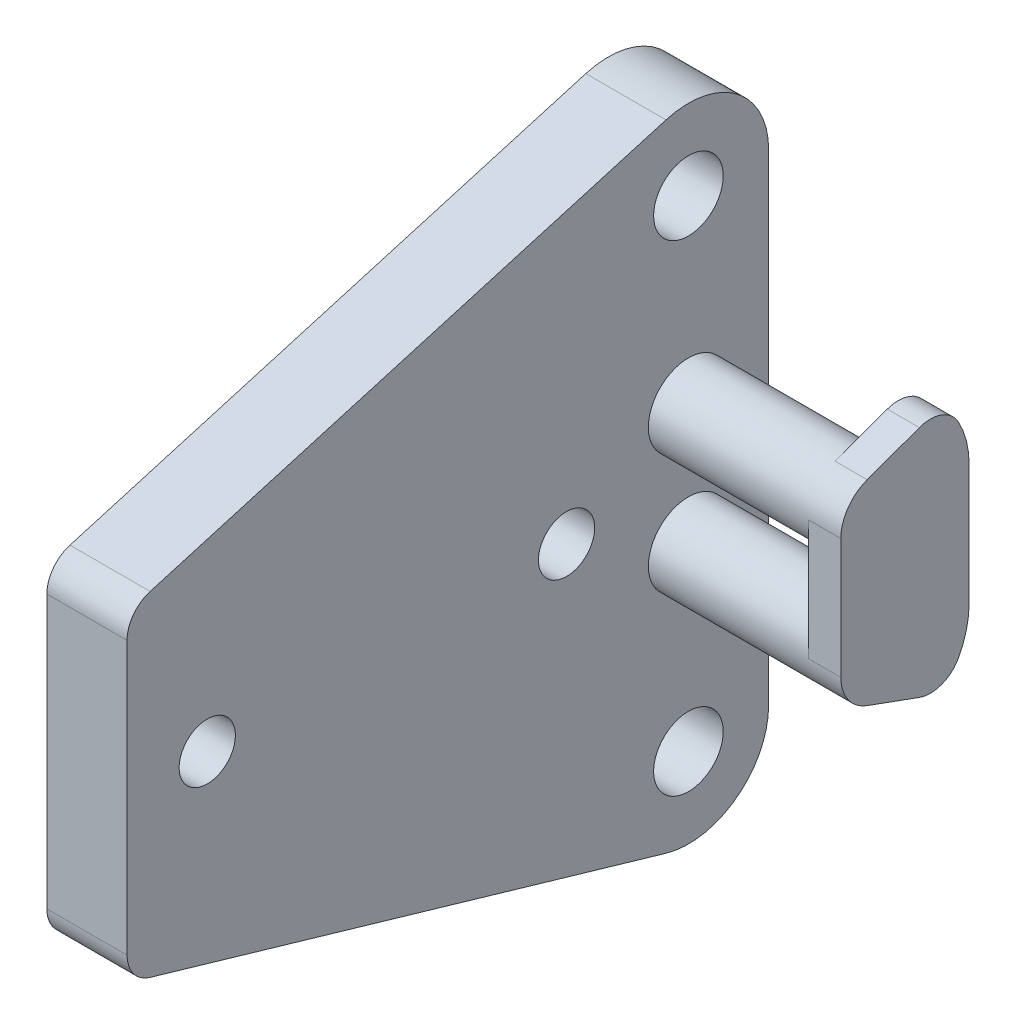
ISO-10303-21;
HEADER;
FILE_DESCRIPTION(('STEP AP214'),'2;1');
FILE_NAME('part.step','',(''),(''),'','','');
FILE_SCHEMA(('AUTOMOTIVE_DESIGN { 1 0 10303 214 1 1 1 1 }'));
ENDSEC;
DATA;
#1=APPLICATION_CONTEXT('core data for automotive mechanical design processes');
#2=APPLICATION_PROTOCOL_DEFINITION('international standard','automotive_design',2000,#1);
#3=PRODUCT_CONTEXT('',#1,'mechanical');
#4=PRODUCT('Part','Part','',(#3));
#5=PRODUCT_RELATED_PRODUCT_CATEGORY('part','',(#4));
#6=PRODUCT_DEFINITION_FORMATION('','',#4);
#7=PRODUCT_DEFINITION_CONTEXT('part definition',#1,'design');
#8=PRODUCT_DEFINITION('design','',#6,#7);
#9=PRODUCT_DEFINITION_SHAPE('','',#8);
#10=(LENGTH_UNIT() NAMED_UNIT(*) SI_UNIT(.MILLI.,.METRE.));
#11=(NAMED_UNIT(*) PLANE_ANGLE_UNIT() SI_UNIT($,.RADIAN.));
#12=(NAMED_UNIT(*) SI_UNIT($,.STERADIAN.) SOLID_ANGLE_UNIT());
#13=UNCERTAINTY_MEASURE_WITH_UNIT(LENGTH_MEASURE(1.E-05),#10,'distance_accuracy_value','');
#14=(GEOMETRIC_REPRESENTATION_CONTEXT(3) GLOBAL_UNCERTAINTY_ASSIGNED_CONTEXT((#13)) GLOBAL_UNIT_ASSIGNED_CONTEXT((#10,
#11,#12)) REPRESENTATION_CONTEXT('',''));
#15=CARTESIAN_POINT('',(0.,0.,0.));
#16=DIRECTION('',(0.,0.,1.));
#17=DIRECTION('',(1.,0.,0.));
#18=AXIS2_PLACEMENT_3D('',#15,#16,#17);
#19=CARTESIAN_POINT('',(-6.35,12.7,44.45));
#20=DIRECTION('',(0.,0.96,0.28));
#21=DIRECTION('',(0.,-0.28,0.96));
#22=AXIS2_PLACEMENT_3D('',#19,#20,#21);
#23=PLANE('',#22);
#24=DIRECTION('',(0.,-0.28,0.96));
#25=VECTOR('',#24,1.);
#26=CARTESIAN_POINT('',(-6.35,12.7,44.45));
#27=LINE('',#26,#25);
#28=CARTESIAN_POINT('',(-6.35,25.146,1.778));
#29=VERTEX_POINT('',#28);
#30=CARTESIAN_POINT('',(-6.35,13.2334,42.6212));
#31=VERTEX_POINT('',#30);
#32=EDGE_CURVE('E222',#29,#31,#27,.T.);
#33=ORIENTED_EDGE('',*,*,#32,.T.);
#34=DIRECTION('',(1.,0.,0.));
#35=VECTOR('',#34,1.);
#36=CARTESIAN_POINT('',(-6.35,13.2334,42.6212));
#37=LINE('',#36,#35);
#38=CARTESIAN_POINT('',(0.,13.2334,42.6212));
#39=VERTEX_POINT('',#38);
#40=EDGE_CURVE('E11',#31,#39,#37,.T.);
#41=ORIENTED_EDGE('',*,*,#40,.T.);
#42=DIRECTION('',(0.,-0.28,0.96));
#43=VECTOR('',#42,1.);
#44=CARTESIAN_POINT('',(0.,12.7,44.45));
#45=LINE('',#44,#43);
#46=CARTESIAN_POINT('',(0.,25.146,1.778));
#47=VERTEX_POINT('',#46);
#48=EDGE_CURVE('E219',#47,#39,#45,.T.);
#49=ORIENTED_EDGE('',*,*,#48,.F.);
#50=DIRECTION('',(1.,0.,0.));
#51=VECTOR('',#50,1.);
#52=CARTESIAN_POINT('',(-6.35,25.146,1.778));
#53=LINE('',#52,#51);
#54=EDGE_CURVE('E255',#29,#47,#53,.T.);
#55=ORIENTED_EDGE('',*,*,#54,.F.);
#56=EDGE_LOOP('',(#33,#41,#49,#55));
#57=FACE_BOUND('',#56,.T.);
#58=ADVANCED_FACE('F33',(#57),#23,.T.);
#59=CARTESIAN_POINT('',(-6.35,19.05,0.));
#60=DIRECTION('',(1.,0.,0.));
#61=DIRECTION('',(0.,0.,-1.));
#62=AXIS2_PLACEMENT_3D('',#59,#60,#61);
#63=CYLINDRICAL_SURFACE('',#62,6.35);
#64=CARTESIAN_POINT('',(0.,19.05,0.));
#65=DIRECTION('',(1.,0.,0.));
#66=DIRECTION('',(0.,0.,1.));
#67=AXIS2_PLACEMENT_3D('',#64,#65,#66);
#68=CIRCLE('',#67,6.35);
#69=CARTESIAN_POINT('',(0.,19.05,-6.35000000000001));
#70=VERTEX_POINT('',#69);
#71=EDGE_CURVE('E225',#70,#47,#68,.T.);
#72=ORIENTED_EDGE('',*,*,#71,.F.);
#73=DIRECTION('',(1.,0.,0.));
#74=VECTOR('',#73,1.);
#75=CARTESIAN_POINT('',(-6.35,19.05,-6.35000000000001));
#76=LINE('',#75,#74);
#77=CARTESIAN_POINT('',(-6.35,19.05,-6.35000000000001));
#78=VERTEX_POINT('',#77);
#79=EDGE_CURVE('E258',#78,#70,#76,.T.);
#80=ORIENTED_EDGE('',*,*,#79,.F.);
#81=CARTESIAN_POINT('',(-6.35,19.05,0.));
#82=DIRECTION('',(1.,0.,0.));
#83=DIRECTION('',(0.,0.,1.));
#84=AXIS2_PLACEMENT_3D('',#81,#82,#83);
#85=CIRCLE('',#84,6.35);
#86=EDGE_CURVE('E236',#78,#29,#85,.T.);
#87=ORIENTED_EDGE('',*,*,#86,.T.);
#88=ORIENTED_EDGE('',*,*,#54,.T.);
#89=EDGE_LOOP('',(#72,#80,#87,#88));
#90=FACE_BOUND('',#89,.T.);
#91=ADVANCED_FACE('F318',(#90),#63,.T.);
#92=CARTESIAN_POINT('',(-6.35,-19.05,-6.35000000000001));
#93=DIRECTION('',(0.,0.,-1.));
#94=DIRECTION('',(-1.,0.,0.));
#95=AXIS2_PLACEMENT_3D('',#92,#93,#94);
#96=PLANE('',#95);
#97=DIRECTION('',(0.,1.,0.));
#98=VECTOR('',#97,1.);
#99=CARTESIAN_POINT('',(0.,-19.05,-6.35000000000001));
#100=LINE('',#99,#98);
#101=CARTESIAN_POINT('',(0.,-19.05,-6.35000000000001));
#102=VERTEX_POINT('',#101);
#103=EDGE_CURVE('E250',#102,#70,#100,.T.);
#104=ORIENTED_EDGE('',*,*,#103,.F.);
#105=DIRECTION('',(1.,0.,0.));
#106=VECTOR('',#105,1.);
#107=CARTESIAN_POINT('',(-6.35,-19.05,-6.35000000000001));
#108=LINE('',#107,#106);
#109=CARTESIAN_POINT('',(-6.35,-19.05,-6.35000000000001));
#110=VERTEX_POINT('',#109);
#111=EDGE_CURVE('E260',#110,#102,#108,.T.);
#112=ORIENTED_EDGE('',*,*,#111,.F.);
#113=DIRECTION('',(0.,1.,0.));
#114=VECTOR('',#113,1.);
#115=CARTESIAN_POINT('',(-6.35,-19.05,-6.35000000000001));
#116=LINE('',#115,#114);
#117=EDGE_CURVE('E233',#110,#78,#116,.T.);
#118=ORIENTED_EDGE('',*,*,#117,.T.);
#119=ORIENTED_EDGE('',*,*,#79,.T.);
#120=EDGE_LOOP('',(#104,#112,#118,#119));
#121=FACE_BOUND('',#120,.T.);
#122=ADVANCED_FACE('F334',(#121),#96,.T.);
#123=CARTESIAN_POINT('',(-6.35,-19.05,0.));
#124=DIRECTION('',(1.,0.,0.));
#125=DIRECTION('',(0.,0.,-1.));
#126=AXIS2_PLACEMENT_3D('',#123,#124,#125);
#127=CYLINDRICAL_SURFACE('',#126,6.35);
#128=CARTESIAN_POINT('',(0.,-19.05,0.));
#129=DIRECTION('',(1.,0.,0.));
#130=DIRECTION('',(0.,0.,-1.));
#131=AXIS2_PLACEMENT_3D('',#128,#129,#130);
#132=CIRCLE('',#131,6.35);
#133=CARTESIAN_POINT('',(0.,-25.146,1.77799999999999));
#134=VERTEX_POINT('',#133);
#135=EDGE_CURVE('E247',#134,#102,#132,.T.);
#136=ORIENTED_EDGE('',*,*,#135,.F.);
#137=DIRECTION('',(1.,0.,0.));
#138=VECTOR('',#137,1.);
#139=CARTESIAN_POINT('',(-6.35,-25.146,1.77799999999999));
#140=LINE('',#139,#138);
#141=CARTESIAN_POINT('',(-6.35,-25.146,1.77799999999999));
#142=VERTEX_POINT('',#141);
#143=EDGE_CURVE('E239',#142,#134,#140,.T.);
#144=ORIENTED_EDGE('',*,*,#143,.F.);
#145=CARTESIAN_POINT('',(-6.35,-19.05,0.));
#146=DIRECTION('',(1.,0.,0.));
#147=DIRECTION('',(0.,0.,-1.));
#148=AXIS2_PLACEMENT_3D('',#145,#146,#147);
#149=CIRCLE('',#148,6.35);
#150=EDGE_CURVE('E230',#142,#110,#149,.T.);
#151=ORIENTED_EDGE('',*,*,#150,.T.);
#152=ORIENTED_EDGE('',*,*,#111,.T.);
#153=EDGE_LOOP('',(#136,#144,#151,#152));
#154=FACE_BOUND('',#153,.T.);
#155=ADVANCED_FACE('F313',(#154),#127,.T.);
#156=CARTESIAN_POINT('',(-6.35,-12.7,44.45));
#157=DIRECTION('',(0.,-0.96,0.28));
#158=DIRECTION('',(0.,-0.28,-0.96));
#159=AXIS2_PLACEMENT_3D('',#156,#157,#158);
#160=PLANE('',#159);
#161=DIRECTION('',(0.,-0.28,-0.96));
#162=VECTOR('',#161,1.);
#163=CARTESIAN_POINT('',(0.,-12.7,44.45));
#164=LINE('',#163,#162);
#165=CARTESIAN_POINT('',(0.,-13.2334,42.6212));
#166=VERTEX_POINT('',#165);
#167=EDGE_CURVE('E245',#166,#134,#164,.T.);
#168=ORIENTED_EDGE('',*,*,#167,.F.);
#169=DIRECTION('',(1.,0.,0.));
#170=VECTOR('',#169,1.);
#171=CARTESIAN_POINT('',(-6.35,-13.2334,42.6212));
#172=LINE('',#171,#170);
#173=CARTESIAN_POINT('',(-6.35,-13.2334,42.6212));
#174=VERTEX_POINT('',#173);
#175=EDGE_CURVE('E56',#166,#174,#172,.F.);
#176=ORIENTED_EDGE('',*,*,#175,.T.);
#177=DIRECTION('',(0.,-0.28,-0.96));
#178=VECTOR('',#177,1.);
#179=CARTESIAN_POINT('',(-6.35,-12.7,44.45));
#180=LINE('',#179,#178);
#181=EDGE_CURVE('E228',#174,#142,#180,.T.);
#182=ORIENTED_EDGE('',*,*,#181,.T.);
#183=ORIENTED_EDGE('',*,*,#143,.T.);
#184=EDGE_LOOP('',(#168,#176,#182,#183));
#185=FACE_BOUND('',#184,.T.);
#186=ADVANCED_FACE('F309',(#185),#160,.T.);
#187=CARTESIAN_POINT('',(-6.35,12.7,44.45));
#188=DIRECTION('',(0.,0.,1.));
#189=DIRECTION('',(1.,0.,0.));
#190=AXIS2_PLACEMENT_3D('',#187,#188,#189);
#191=PLANE('',#190);
#192=DIRECTION('',(0.,-1.,0.));
#193=VECTOR('',#192,1.);
#194=CARTESIAN_POINT('',(-6.35,12.7,44.45));
#195=LINE('',#194,#193);
#196=CARTESIAN_POINT('',(-6.35,10.795,44.45));
#197=VERTEX_POINT('',#196);
#198=CARTESIAN_POINT('',(-6.35,-10.795,44.45));
#199=VERTEX_POINT('',#198);
#200=EDGE_CURVE('E224',#197,#199,#195,.T.);
#201=ORIENTED_EDGE('',*,*,#200,.T.);
#202=DIRECTION('',(1.,0.,0.));
#203=VECTOR('',#202,1.);
#204=CARTESIAN_POINT('',(-6.35,-10.795,44.45));
#205=LINE('',#204,#203);
#206=CARTESIAN_POINT('',(0.,-10.795,44.45));
#207=VERTEX_POINT('',#206);
#208=EDGE_CURVE('E289',#199,#207,#205,.T.);
#209=ORIENTED_EDGE('',*,*,#208,.T.);
#210=DIRECTION('',(0.,-1.,0.));
#211=VECTOR('',#210,1.);
#212=CARTESIAN_POINT('',(0.,12.7,44.45));
#213=LINE('',#212,#211);
#214=CARTESIAN_POINT('',(0.,10.795,44.45));
#215=VERTEX_POINT('',#214);
#216=EDGE_CURVE('E242',#215,#207,#213,.T.);
#217=ORIENTED_EDGE('',*,*,#216,.F.);
#218=DIRECTION('',(1.,0.,0.));
#219=VECTOR('',#218,1.);
#220=CARTESIAN_POINT('',(-6.35,10.795,44.45));
#221=LINE('',#220,#219);
#222=EDGE_CURVE('E287',#215,#197,#221,.F.);
#223=ORIENTED_EDGE('',*,*,#222,.T.);
#224=EDGE_LOOP('',(#201,#209,#217,#223));
#225=FACE_BOUND('',#224,.T.);
#226=ADVANCED_FACE('F303',(#225),#191,.T.);
#227=CARTESIAN_POINT('',(-6.35,19.05,0.));
#228=DIRECTION('',(-1.,0.,0.));
#229=DIRECTION('',(0.,0.,1.));
#230=AXIS2_PLACEMENT_3D('',#227,#228,#229);
#231=PLANE('',#230);
#232=CARTESIAN_POINT('',(-6.35,-19.05,0.));
#233=DIRECTION('',(1.,0.,0.));
#234=DIRECTION('',(0.,0.,-1.));
#235=AXIS2_PLACEMENT_3D('',#232,#233,#234);
#236=CIRCLE('',#235,2.7559);
#237=CARTESIAN_POINT('',(-6.35,-19.05,-2.7559));
#238=VERTEX_POINT('',#237);
#239=EDGE_CURVE('E198',#238,#238,#236,.T.);
#240=ORIENTED_EDGE('',*,*,#239,.T.);
#241=EDGE_LOOP('',(#240));
#242=FACE_BOUND('',#241,.T.);
#243=CARTESIAN_POINT('',(-6.35,19.05,0.));
#244=DIRECTION('',(1.,0.,0.));
#245=DIRECTION('',(0.,0.,1.));
#246=AXIS2_PLACEMENT_3D('',#243,#244,#245);
#247=CIRCLE('',#246,2.75590000000001);
#248=CARTESIAN_POINT('',(-6.35,19.05,2.75590000000002));
#249=VERTEX_POINT('',#248);
#250=EDGE_CURVE('E204',#249,#249,#247,.T.);
#251=ORIENTED_EDGE('',*,*,#250,.T.);
#252=EDGE_LOOP('',(#251));
#253=FACE_BOUND('',#252,.T.);
#254=CARTESIAN_POINT('',(-6.35,0.,9.65199999999999));
#255=DIRECTION('',(1.,0.,0.));
#256=DIRECTION('',(0.,0.,-1.));
#257=AXIS2_PLACEMENT_3D('',#254,#255,#256);
#258=CIRCLE('',#257,2.22670754032473);
#259=CARTESIAN_POINT('',(-6.35,0.,7.42529245967526));
#260=VERTEX_POINT('',#259);
#261=EDGE_CURVE('E210',#260,#260,#258,.T.);
#262=ORIENTED_EDGE('',*,*,#261,.T.);
#263=EDGE_LOOP('',(#262));
#264=FACE_BOUND('',#263,.T.);
#265=CARTESIAN_POINT('',(-6.35,0.,38.1));
#266=DIRECTION('',(1.,0.,0.));
#267=DIRECTION('',(0.,0.,-1.));
#268=AXIS2_PLACEMENT_3D('',#265,#266,#267);
#269=CIRCLE('',#268,2.22670754032473);
#270=CARTESIAN_POINT('',(-6.35,0.,35.8732924596753));
#271=VERTEX_POINT('',#270);
#272=EDGE_CURVE('E216',#271,#271,#269,.T.);
#273=ORIENTED_EDGE('',*,*,#272,.T.);
#274=EDGE_LOOP('',(#273));
#275=FACE_BOUND('',#274,.T.);
#276=ORIENTED_EDGE('',*,*,#181,.F.);
#277=CARTESIAN_POINT('',(-6.35,-10.795,41.91));
#278=DIRECTION('',(-1.,0.,0.));
#279=DIRECTION('',(0.,0.,1.));
#280=AXIS2_PLACEMENT_3D('',#277,#278,#279);
#281=CIRCLE('',#280,2.54);
#282=EDGE_CURVE('E41',#174,#199,#281,.T.);
#283=ORIENTED_EDGE('',*,*,#282,.T.);
#284=ORIENTED_EDGE('',*,*,#200,.F.);
#285=CARTESIAN_POINT('',(-6.35,10.795,41.91));
#286=DIRECTION('',(-1.,0.,0.));
#287=DIRECTION('',(0.,0.,1.));
#288=AXIS2_PLACEMENT_3D('',#285,#286,#287);
#289=CIRCLE('',#288,2.54);
#290=EDGE_CURVE('E48',#197,#31,#289,.T.);
#291=ORIENTED_EDGE('',*,*,#290,.T.);
#292=ORIENTED_EDGE('',*,*,#32,.F.);
#293=ORIENTED_EDGE('',*,*,#86,.F.);
#294=ORIENTED_EDGE('',*,*,#117,.F.);
#295=ORIENTED_EDGE('',*,*,#150,.F.);
#296=EDGE_LOOP('',(#276,#283,#284,#291,#292,#293,#294,#295));
#297=FACE_BOUND('',#296,.T.);
#298=ADVANCED_FACE('F298',(#242,#253,#264,#275,#297),#231,.T.);
#299=CARTESIAN_POINT('',(0.,19.05,0.));
#300=DIRECTION('',(-1.,0.,0.));
#301=DIRECTION('',(0.,0.,1.));
#302=AXIS2_PLACEMENT_3D('',#299,#300,#301);
#303=PLANE('',#302);
#304=CARTESIAN_POINT('',(0.,4.7625,0.));
#305=DIRECTION('',(-1.,0.,0.));
#306=DIRECTION('',(0.,0.,1.));
#307=AXIS2_PLACEMENT_3D('',#304,#305,#306);
#308=CIRCLE('',#307,3.175);
#309=CARTESIAN_POINT('',(0.,4.7625,3.17499999999999));
#310=VERTEX_POINT('',#309);
#311=EDGE_CURVE('E266',#310,#310,#308,.F.);
#312=ORIENTED_EDGE('',*,*,#311,.F.);
#313=EDGE_LOOP('',(#312));
#314=FACE_BOUND('',#313,.T.);
#315=CARTESIAN_POINT('',(0.,-4.7625,0.));
#316=DIRECTION('',(-1.,0.,0.));
#317=DIRECTION('',(0.,0.,1.));
#318=AXIS2_PLACEMENT_3D('',#315,#316,#317);
#319=CIRCLE('',#318,3.175);
#320=CARTESIAN_POINT('',(0.,-4.7625,3.17499999999999));
#321=VERTEX_POINT('',#320);
#322=EDGE_CURVE('E257',#321,#321,#319,.F.);
#323=ORIENTED_EDGE('',*,*,#322,.F.);
#324=EDGE_LOOP('',(#323));
#325=FACE_BOUND('',#324,.T.);
#326=CARTESIAN_POINT('',(0.,-19.05,0.));
#327=DIRECTION('',(1.,0.,0.));
#328=DIRECTION('',(0.,0.,-1.));
#329=AXIS2_PLACEMENT_3D('',#326,#327,#328);
#330=CIRCLE('',#329,2.7559);
#331=CARTESIAN_POINT('',(0.,-19.05,-2.7559));
#332=VERTEX_POINT('',#331);
#333=EDGE_CURVE('E196',#332,#332,#330,.T.);
#334=ORIENTED_EDGE('',*,*,#333,.F.);
#335=EDGE_LOOP('',(#334));
#336=FACE_BOUND('',#335,.T.);
#337=CARTESIAN_POINT('',(0.,19.05,0.));
#338=DIRECTION('',(1.,0.,0.));
#339=DIRECTION('',(0.,0.,1.));
#340=AXIS2_PLACEMENT_3D('',#337,#338,#339);
#341=CIRCLE('',#340,2.75590000000001);
#342=CARTESIAN_POINT('',(0.,19.05,2.75590000000002));
#343=VERTEX_POINT('',#342);
#344=EDGE_CURVE('E201',#343,#343,#341,.T.);
#345=ORIENTED_EDGE('',*,*,#344,.F.);
#346=EDGE_LOOP('',(#345));
#347=FACE_BOUND('',#346,.T.);
#348=CARTESIAN_POINT('',(0.,0.,9.65199999999999));
#349=DIRECTION('',(1.,0.,0.));
#350=DIRECTION('',(0.,0.,-1.));
#351=AXIS2_PLACEMENT_3D('',#348,#349,#350);
#352=CIRCLE('',#351,2.22670754032473);
#353=CARTESIAN_POINT('',(0.,0.,7.42529245967526));
#354=VERTEX_POINT('',#353);
#355=EDGE_CURVE('E207',#354,#354,#352,.T.);
#356=ORIENTED_EDGE('',*,*,#355,.F.);
#357=EDGE_LOOP('',(#356));
#358=FACE_BOUND('',#357,.T.);
#359=CARTESIAN_POINT('',(0.,0.,38.1));
#360=DIRECTION('',(1.,0.,0.));
#361=DIRECTION('',(0.,0.,-1.));
#362=AXIS2_PLACEMENT_3D('',#359,#360,#361);
#363=CIRCLE('',#362,2.22670754032473);
#364=CARTESIAN_POINT('',(0.,0.,35.8732924596753));
#365=VERTEX_POINT('',#364);
#366=EDGE_CURVE('E213',#365,#365,#363,.T.);
#367=ORIENTED_EDGE('',*,*,#366,.F.);
#368=EDGE_LOOP('',(#367));
#369=FACE_BOUND('',#368,.T.);
#370=ORIENTED_EDGE('',*,*,#216,.T.);
#371=CARTESIAN_POINT('',(0.,-10.795,41.91));
#372=DIRECTION('',(-1.,0.,0.));
#373=DIRECTION('',(0.,0.,1.));
#374=AXIS2_PLACEMENT_3D('',#371,#372,#373);
#375=CIRCLE('',#374,2.54);
#376=EDGE_CURVE('E294',#207,#166,#375,.F.);
#377=ORIENTED_EDGE('',*,*,#376,.T.);
#378=ORIENTED_EDGE('',*,*,#167,.T.);
#379=ORIENTED_EDGE('',*,*,#135,.T.);
#380=ORIENTED_EDGE('',*,*,#103,.T.);
#381=ORIENTED_EDGE('',*,*,#71,.T.);
#382=ORIENTED_EDGE('',*,*,#48,.T.);
#383=CARTESIAN_POINT('',(0.,10.795,41.91));
#384=DIRECTION('',(-1.,0.,0.));
#385=DIRECTION('',(0.,0.,1.));
#386=AXIS2_PLACEMENT_3D('',#383,#384,#385);
#387=CIRCLE('',#386,2.54);
#388=EDGE_CURVE('E292',#39,#215,#387,.F.);
#389=ORIENTED_EDGE('',*,*,#388,.T.);
#390=EDGE_LOOP('',(#370,#377,#378,#379,#380,#381,#382,#389));
#391=FACE_BOUND('',#390,.T.);
#392=ADVANCED_FACE('F308',(#314,#325,#336,#347,#358,#369,#391),#303,.F.);
#393=CARTESIAN_POINT('',(-6.35,0.,38.1));
#394=DIRECTION('',(1.,0.,0.));
#395=DIRECTION('',(0.,0.,-1.));
#396=AXIS2_PLACEMENT_3D('',#393,#394,#395);
#397=CYLINDRICAL_SURFACE('',#396,2.22670754032473);
#398=ORIENTED_EDGE('',*,*,#272,.F.);
#399=EDGE_LOOP('',(#398));
#400=FACE_BOUND('',#399,.T.);
#401=ORIENTED_EDGE('',*,*,#366,.T.);
#402=EDGE_LOOP('',(#401));
#403=FACE_BOUND('',#402,.T.);
#404=ADVANCED_FACE('F419',(#400,#403),#397,.F.);
#405=CARTESIAN_POINT('',(-6.35,0.,9.65199999999999));
#406=DIRECTION('',(1.,0.,0.));
#407=DIRECTION('',(0.,0.,-1.));
#408=AXIS2_PLACEMENT_3D('',#405,#406,#407);
#409=CYLINDRICAL_SURFACE('',#408,2.22670754032473);
#410=ORIENTED_EDGE('',*,*,#261,.F.);
#411=EDGE_LOOP('',(#410));
#412=FACE_BOUND('',#411,.T.);
#413=ORIENTED_EDGE('',*,*,#355,.T.);
#414=EDGE_LOOP('',(#413));
#415=FACE_BOUND('',#414,.T.);
#416=ADVANCED_FACE('F431',(#412,#415),#409,.F.);
#417=CARTESIAN_POINT('',(-6.35,19.05,0.));
#418=DIRECTION('',(1.,0.,0.));
#419=DIRECTION('',(0.,0.,-1.));
#420=AXIS2_PLACEMENT_3D('',#417,#418,#419);
#421=CYLINDRICAL_SURFACE('',#420,2.75590000000001);
#422=ORIENTED_EDGE('',*,*,#250,.F.);
#423=EDGE_LOOP('',(#422));
#424=FACE_BOUND('',#423,.T.);
#425=ORIENTED_EDGE('',*,*,#344,.T.);
#426=EDGE_LOOP('',(#425));
#427=FACE_BOUND('',#426,.T.);
#428=ADVANCED_FACE('F437',(#424,#427),#421,.F.);
#429=CARTESIAN_POINT('',(-6.35,-19.05,0.));
#430=DIRECTION('',(1.,0.,0.));
#431=DIRECTION('',(0.,0.,-1.));
#432=AXIS2_PLACEMENT_3D('',#429,#430,#431);
#433=CYLINDRICAL_SURFACE('',#432,2.7559);
#434=ORIENTED_EDGE('',*,*,#239,.F.);
#435=EDGE_LOOP('',(#434));
#436=FACE_BOUND('',#435,.T.);
#437=ORIENTED_EDGE('',*,*,#333,.T.);
#438=EDGE_LOOP('',(#437));
#439=FACE_BOUND('',#438,.T.);
#440=ADVANCED_FACE('F413',(#436,#439),#433,.F.);
#441=CARTESIAN_POINT('',(12.7,-4.7625,0.));
#442=DIRECTION('',(-1.,0.,0.));
#443=DIRECTION('',(0.,0.,1.));
#444=AXIS2_PLACEMENT_3D('',#441,#442,#443);
#445=CYLINDRICAL_SURFACE('',#444,3.175);
#446=CARTESIAN_POINT('',(12.7,-4.7625,0.));
#447=DIRECTION('',(1.,0.,0.));
#448=DIRECTION('',(0.,0.,-1.));
#449=AXIS2_PLACEMENT_3D('',#446,#447,#448);
#450=CIRCLE('',#449,3.175);
#451=CARTESIAN_POINT('',(12.7,-7.74602407099525,1.08591395505901));
#452=VERTEX_POINT('',#451);
#453=CARTESIAN_POINT('',(12.7,-4.7625,3.17499999999999));
#454=VERTEX_POINT('',#453);
#455=EDGE_CURVE('E189',#452,#454,#450,.T.);
#456=ORIENTED_EDGE('',*,*,#455,.F.);
#457=DIRECTION('',(-1.,0.,0.));
#458=VECTOR('',#457,1.);
#459=CARTESIAN_POINT('',(15.24,-7.74602407099525,1.08591395505901));
#460=LINE('',#459,#458);
#461=CARTESIAN_POINT('',(15.24,-7.74602407099525,1.08591395505901));
#462=VERTEX_POINT('',#461);
#463=EDGE_CURVE('E192',#462,#452,#460,.T.);
#464=ORIENTED_EDGE('',*,*,#463,.F.);
#465=CARTESIAN_POINT('',(15.24,-4.7625,0.));
#466=DIRECTION('',(1.,0.,0.));
#467=DIRECTION('',(0.,0.,-1.));
#468=AXIS2_PLACEMENT_3D('',#465,#466,#467);
#469=CIRCLE('',#468,3.175);
#470=CARTESIAN_POINT('',(15.24,-4.7625,3.17499999999999));
#471=VERTEX_POINT('',#470);
#472=EDGE_CURVE('E171',#471,#462,#469,.T.);
#473=ORIENTED_EDGE('',*,*,#472,.F.);
#474=DIRECTION('',(-1.,0.,0.));
#475=VECTOR('',#474,1.);
#476=CARTESIAN_POINT('',(15.24,-4.7625,3.17499999999999));
#477=LINE('',#476,#475);
#478=EDGE_CURVE('E168',#471,#454,#477,.T.);
#479=ORIENTED_EDGE('',*,*,#478,.T.);
#480=EDGE_LOOP('',(#456,#464,#473,#479));
#481=FACE_BOUND('',#480,.T.);
#482=ORIENTED_EDGE('',*,*,#322,.T.);
#483=EDGE_LOOP('',(#482));
#484=FACE_BOUND('',#483,.T.);
#485=ADVANCED_FACE('F410',(#481,#484),#445,.T.);
#486=CARTESIAN_POINT('',(12.7,4.7625,0.));
#487=DIRECTION('',(-1.,0.,0.));
#488=DIRECTION('',(0.,0.,1.));
#489=AXIS2_PLACEMENT_3D('',#486,#487,#488);
#490=CYLINDRICAL_SURFACE('',#489,3.175);
#491=CARTESIAN_POINT('',(12.7,4.7625,0.));
#492=DIRECTION('',(1.,0.,0.));
#493=DIRECTION('',(0.,0.,-1.));
#494=AXIS2_PLACEMENT_3D('',#491,#492,#493);
#495=CIRCLE('',#494,3.175);
#496=CARTESIAN_POINT('',(12.7,4.7625,3.17499999999999));
#497=VERTEX_POINT('',#496);
#498=CARTESIAN_POINT('',(12.7,7.74602407099526,1.08591395505898));
#499=VERTEX_POINT('',#498);
#500=EDGE_CURVE('E187',#497,#499,#495,.T.);
#501=ORIENTED_EDGE('',*,*,#500,.F.);
#502=DIRECTION('',(-1.,0.,0.));
#503=VECTOR('',#502,1.);
#504=CARTESIAN_POINT('',(15.24,4.7625,3.17499999999999));
#505=LINE('',#504,#503);
#506=CARTESIAN_POINT('',(15.24,4.7625,3.17499999999999));
#507=VERTEX_POINT('',#506);
#508=EDGE_CURVE('E166',#507,#497,#505,.T.);
#509=ORIENTED_EDGE('',*,*,#508,.F.);
#510=CARTESIAN_POINT('',(15.24,4.7625,0.));
#511=DIRECTION('',(1.,0.,0.));
#512=DIRECTION('',(0.,0.,1.));
#513=AXIS2_PLACEMENT_3D('',#510,#511,#512);
#514=CIRCLE('',#513,3.175);
#515=CARTESIAN_POINT('',(15.24,7.74602407099526,1.08591395505898));
#516=VERTEX_POINT('',#515);
#517=EDGE_CURVE('E172',#516,#507,#514,.T.);
#518=ORIENTED_EDGE('',*,*,#517,.F.);
#519=DIRECTION('',(-1.,0.,0.));
#520=VECTOR('',#519,1.);
#521=CARTESIAN_POINT('',(15.24,7.74602407099526,1.08591395505898));
#522=LINE('',#521,#520);
#523=EDGE_CURVE('E372',#516,#499,#522,.T.);
#524=ORIENTED_EDGE('',*,*,#523,.T.);
#525=EDGE_LOOP('',(#501,#509,#518,#524));
#526=FACE_BOUND('',#525,.T.);
#527=ORIENTED_EDGE('',*,*,#311,.T.);
#528=EDGE_LOOP('',(#527));
#529=FACE_BOUND('',#528,.T.);
#530=ADVANCED_FACE('F184',(#526,#529),#490,.T.);
#531=CARTESIAN_POINT('',(15.24,4.7625,3.17499999999999));
#532=DIRECTION('',(0.,0.,-1.));
#533=DIRECTION('',(0.,1.,0.));
#534=AXIS2_PLACEMENT_3D('',#531,#532,#533);
#535=PLANE('',#534);
#536=DIRECTION('',(0.,-1.,0.));
#537=VECTOR('',#536,1.);
#538=CARTESIAN_POINT('',(12.7,4.7625,3.17499999999999));
#539=LINE('',#538,#537);
#540=EDGE_CURVE('E373',#497,#454,#539,.T.);
#541=ORIENTED_EDGE('',*,*,#540,.T.);
#542=ORIENTED_EDGE('',*,*,#478,.F.);
#543=DIRECTION('',(0.,-1.,0.));
#544=VECTOR('',#543,1.);
#545=CARTESIAN_POINT('',(15.24,4.7625,3.17499999999999));
#546=LINE('',#545,#544);
#547=EDGE_CURVE('E161',#507,#471,#546,.T.);
#548=ORIENTED_EDGE('',*,*,#547,.F.);
#549=ORIENTED_EDGE('',*,*,#508,.T.);
#550=EDGE_LOOP('',(#541,#542,#548,#549));
#551=FACE_BOUND('',#550,.T.);
#552=ADVANCED_FACE('F164',(#551),#535,.F.);
#553=CARTESIAN_POINT('',(15.24,-9.87397214656498,-4.76057533234066));
#554=DIRECTION('',(0.,0.939692620785907,-0.342020143325672));
#555=DIRECTION('',(0.,0.342020143325672,0.939692620785907));
#556=AXIS2_PLACEMENT_3D('',#553,#554,#555);
#557=PLANE('',#556);
#558=DIRECTION('',(0.,-0.342020143325672,-0.939692620785907));
#559=VECTOR('',#558,1.);
#560=CARTESIAN_POINT('',(12.7,-9.87397214656498,-4.76057533234066));
#561=LINE('',#560,#559);
#562=CARTESIAN_POINT('',(12.7,-9.25071058524347,-3.0481782661958));
#563=VERTEX_POINT('',#562);
#564=EDGE_CURVE('E375',#452,#563,#561,.T.);
#565=ORIENTED_EDGE('',*,*,#564,.T.);
#566=DIRECTION('',(-1.,0.,0.));
#567=VECTOR('',#566,1.);
#568=CARTESIAN_POINT('',(15.24,-9.25071058524347,-3.0481782661958));
#569=LINE('',#568,#567);
#570=CARTESIAN_POINT('',(15.24,-9.25071058524347,-3.0481782661958));
#571=VERTEX_POINT('',#570);
#572=EDGE_CURVE('E285',#563,#571,#569,.F.);
#573=ORIENTED_EDGE('',*,*,#572,.T.);
#574=DIRECTION('',(0.,-0.342020143325672,-0.939692620785907));
#575=VECTOR('',#574,1.);
#576=CARTESIAN_POINT('',(15.24,-9.87397214656498,-4.76057533234066));
#577=LINE('',#576,#575);
#578=EDGE_CURVE('E356',#462,#571,#577,.T.);
#579=ORIENTED_EDGE('',*,*,#578,.F.);
#580=ORIENTED_EDGE('',*,*,#463,.T.);
#581=EDGE_LOOP('',(#565,#573,#579,#580));
#582=FACE_BOUND('',#581,.T.);
#583=ADVANCED_FACE('F394',(#582),#557,.F.);
#584=CARTESIAN_POINT('',(15.24,-4.7625,0.));
#585=DIRECTION('',(-1.,0.,0.));
#586=DIRECTION('',(0.,0.,1.));
#587=AXIS2_PLACEMENT_3D('',#584,#585,#586);
#588=CYLINDRICAL_SURFACE('',#587,6.985);
#589=CARTESIAN_POINT('',(15.24,-4.7625,0.));
#590=DIRECTION('',(1.,0.,0.));
#591=DIRECTION('',(0.,0.,-1.));
#592=AXIS2_PLACEMENT_3D('',#589,#590,#591);
#593=CIRCLE('',#592,6.985);
#594=CARTESIAN_POINT('',(15.24,-8.06468637327428,-6.15514339038187));
#595=VERTEX_POINT('',#594);
#596=CARTESIAN_POINT('',(15.24,-4.7625,-6.985));
#597=VERTEX_POINT('',#596);
#598=EDGE_CURVE('E353',#595,#597,#593,.T.);
#599=ORIENTED_EDGE('',*,*,#598,.F.);
#600=DIRECTION('',(-1.,0.,0.));
#601=VECTOR('',#600,1.);
#602=CARTESIAN_POINT('',(15.24,-8.06468637327428,-6.15514339038188));
#603=LINE('',#602,#601);
#604=CARTESIAN_POINT('',(12.7,-8.06468637327428,-6.15514339038187));
#605=VERTEX_POINT('',#604);
#606=EDGE_CURVE('E282',#595,#605,#603,.T.);
#607=ORIENTED_EDGE('',*,*,#606,.T.);
#608=CARTESIAN_POINT('',(12.7,-4.7625,0.));
#609=DIRECTION('',(1.,0.,0.));
#610=DIRECTION('',(0.,0.,-1.));
#611=AXIS2_PLACEMENT_3D('',#608,#609,#610);
#612=CIRCLE('',#611,6.985);
#613=CARTESIAN_POINT('',(12.7,-4.7625,-6.985));
#614=VERTEX_POINT('',#613);
#615=EDGE_CURVE('E378',#605,#614,#612,.T.);
#616=ORIENTED_EDGE('',*,*,#615,.T.);
#617=DIRECTION('',(-1.,0.,0.));
#618=VECTOR('',#617,1.);
#619=CARTESIAN_POINT('',(15.24,-4.7625,-6.985));
#620=LINE('',#619,#618);
#621=EDGE_CURVE('E361',#597,#614,#620,.T.);
#622=ORIENTED_EDGE('',*,*,#621,.F.);
#623=EDGE_LOOP('',(#599,#607,#616,#622));
#624=FACE_BOUND('',#623,.T.);
#625=ADVANCED_FACE('F358',(#624),#588,.T.);
#626=CARTESIAN_POINT('',(15.24,4.7625,-6.985));
#627=DIRECTION('',(0.,0.,1.));
#628=DIRECTION('',(0.,-1.,0.));
#629=AXIS2_PLACEMENT_3D('',#626,#627,#628);
#630=PLANE('',#629);
#631=DIRECTION('',(0.,1.,0.));
#632=VECTOR('',#631,1.);
#633=CARTESIAN_POINT('',(12.7,4.7625,-6.985));
#634=LINE('',#633,#632);
#635=CARTESIAN_POINT('',(12.7,4.7625,-6.985));
#636=VERTEX_POINT('',#635);
#637=EDGE_CURVE('E380',#614,#636,#634,.T.);
#638=ORIENTED_EDGE('',*,*,#637,.T.);
#639=DIRECTION('',(-1.,0.,0.));
#640=VECTOR('',#639,1.);
#641=CARTESIAN_POINT('',(15.24,4.7625,-6.985));
#642=LINE('',#641,#640);
#643=CARTESIAN_POINT('',(15.24,4.7625,-6.985));
#644=VERTEX_POINT('',#643);
#645=EDGE_CURVE('E387',#644,#636,#642,.T.);
#646=ORIENTED_EDGE('',*,*,#645,.F.);
#647=DIRECTION('',(0.,1.,0.));
#648=VECTOR('',#647,1.);
#649=CARTESIAN_POINT('',(15.24,4.7625,-6.985));
#650=LINE('',#649,#648);
#651=EDGE_CURVE('E363',#597,#644,#650,.T.);
#652=ORIENTED_EDGE('',*,*,#651,.F.);
#653=ORIENTED_EDGE('',*,*,#621,.T.);
#654=EDGE_LOOP('',(#638,#646,#652,#653));
#655=FACE_BOUND('',#654,.T.);
#656=ADVANCED_FACE('F401',(#655),#630,.F.);
#657=CARTESIAN_POINT('',(15.24,4.7625,0.));
#658=DIRECTION('',(-1.,0.,0.));
#659=DIRECTION('',(0.,0.,1.));
#660=AXIS2_PLACEMENT_3D('',#657,#658,#659);
#661=CYLINDRICAL_SURFACE('',#660,6.985);
#662=CARTESIAN_POINT('',(12.7,4.7625,0.));
#663=DIRECTION('',(1.,0.,0.));
#664=DIRECTION('',(0.,0.,1.));
#665=AXIS2_PLACEMENT_3D('',#662,#663,#664);
#666=CIRCLE('',#665,6.985);
#667=CARTESIAN_POINT('',(12.7,8.06468637327423,-6.1551433903819));
#668=VERTEX_POINT('',#667);
#669=EDGE_CURVE('E382',#636,#668,#666,.T.);
#670=ORIENTED_EDGE('',*,*,#669,.T.);
#671=DIRECTION('',(-1.,0.,0.));
#672=VECTOR('',#671,1.);
#673=CARTESIAN_POINT('',(15.24,8.06468637327423,-6.1551433903819));
#674=LINE('',#673,#672);
#675=CARTESIAN_POINT('',(15.24,8.06468637327423,-6.1551433903819));
#676=VERTEX_POINT('',#675);
#677=EDGE_CURVE('E276',#668,#676,#674,.F.);
#678=ORIENTED_EDGE('',*,*,#677,.T.);
#679=CARTESIAN_POINT('',(15.24,4.7625,0.));
#680=DIRECTION('',(1.,0.,0.));
#681=DIRECTION('',(0.,0.,1.));
#682=AXIS2_PLACEMENT_3D('',#679,#680,#681);
#683=CIRCLE('',#682,6.985);
#684=EDGE_CURVE('E365',#644,#676,#683,.T.);
#685=ORIENTED_EDGE('',*,*,#684,.F.);
#686=ORIENTED_EDGE('',*,*,#645,.T.);
#687=EDGE_LOOP('',(#670,#678,#685,#686));
#688=FACE_BOUND('',#687,.T.);
#689=ADVANCED_FACE('F489',(#688),#661,.T.);
#690=CARTESIAN_POINT('',(15.24,9.87397214656495,-4.7605753323407));
#691=DIRECTION('',(0.,-0.939692620785909,-0.342020143325666));
#692=DIRECTION('',(0.,0.342020143325666,-0.939692620785909));
#693=AXIS2_PLACEMENT_3D('',#690,#691,#692);
#694=PLANE('',#693);
#695=DIRECTION('',(0.,-0.342020143325666,0.939692620785909));
#696=VECTOR('',#695,1.);
#697=CARTESIAN_POINT('',(15.24,9.87397214656495,-4.7605753323407));
#698=LINE('',#697,#696);
#699=CARTESIAN_POINT('',(15.24,9.25071058524345,-3.04817826619583));
#700=VERTEX_POINT('',#699);
#701=EDGE_CURVE('E178',#700,#516,#698,.T.);
#702=ORIENTED_EDGE('',*,*,#701,.F.);
#703=DIRECTION('',(-1.,0.,0.));
#704=VECTOR('',#703,1.);
#705=CARTESIAN_POINT('',(15.24,9.25071058524345,-3.04817826619583));
#706=LINE('',#705,#704);
#707=CARTESIAN_POINT('',(12.7,9.25071058524345,-3.04817826619583));
#708=VERTEX_POINT('',#707);
#709=EDGE_CURVE('E269',#700,#708,#706,.T.);
#710=ORIENTED_EDGE('',*,*,#709,.T.);
#711=DIRECTION('',(0.,-0.342020143325666,0.939692620785909));
#712=VECTOR('',#711,1.);
#713=CARTESIAN_POINT('',(12.7,9.87397214656495,-4.7605753323407));
#714=LINE('',#713,#712);
#715=EDGE_CURVE('E182',#708,#499,#714,.T.);
#716=ORIENTED_EDGE('',*,*,#715,.T.);
#717=ORIENTED_EDGE('',*,*,#523,.F.);
#718=EDGE_LOOP('',(#702,#710,#716,#717));
#719=FACE_BOUND('',#718,.T.);
#720=ADVANCED_FACE('F409',(#719),#694,.F.);
#721=CARTESIAN_POINT('',(15.24,4.7625,0.));
#722=DIRECTION('',(-1.,0.,0.));
#723=DIRECTION('',(0.,0.,1.));
#724=AXIS2_PLACEMENT_3D('',#721,#722,#723);
#725=PLANE('',#724);
#726=ORIENTED_EDGE('',*,*,#684,.T.);
#727=CARTESIAN_POINT('',(15.24,6.86389132844724,-3.91690943024303));
#728=DIRECTION('',(-1.,0.,0.));
#729=DIRECTION('',(0.,0.,1.));
#730=AXIS2_PLACEMENT_3D('',#727,#728,#729);
#731=CIRCLE('',#730,2.54);
#732=EDGE_CURVE('E280',#676,#700,#731,.F.);
#733=ORIENTED_EDGE('',*,*,#732,.T.);
#734=ORIENTED_EDGE('',*,*,#701,.T.);
#735=ORIENTED_EDGE('',*,*,#517,.T.);
#736=ORIENTED_EDGE('',*,*,#547,.T.);
#737=ORIENTED_EDGE('',*,*,#472,.T.);
#738=ORIENTED_EDGE('',*,*,#578,.T.);
#739=CARTESIAN_POINT('',(15.24,-6.86389132844727,-3.91690943024301));
#740=DIRECTION('',(-1.,0.,0.));
#741=DIRECTION('',(0.,0.,1.));
#742=AXIS2_PLACEMENT_3D('',#739,#740,#741);
#743=CIRCLE('',#742,2.54);
#744=EDGE_CURVE('E278',#571,#595,#743,.F.);
#745=ORIENTED_EDGE('',*,*,#744,.T.);
#746=ORIENTED_EDGE('',*,*,#598,.T.);
#747=ORIENTED_EDGE('',*,*,#651,.T.);
#748=EDGE_LOOP('',(#726,#733,#734,#735,#736,#737,#738,#745,#746,#747));
#749=FACE_BOUND('',#748,.T.);
#750=ADVANCED_FACE('F176',(#749),#725,.F.);
#751=CARTESIAN_POINT('',(12.7,4.7625,0.));
#752=DIRECTION('',(-1.,0.,0.));
#753=DIRECTION('',(0.,0.,1.));
#754=AXIS2_PLACEMENT_3D('',#751,#752,#753);
#755=PLANE('',#754);
#756=ORIENTED_EDGE('',*,*,#715,.F.);
#757=CARTESIAN_POINT('',(12.7,6.86389132844724,-3.91690943024303));
#758=DIRECTION('',(-1.,0.,0.));
#759=DIRECTION('',(0.,0.,1.));
#760=AXIS2_PLACEMENT_3D('',#757,#758,#759);
#761=CIRCLE('',#760,2.54);
#762=EDGE_CURVE('E274',#708,#668,#761,.T.);
#763=ORIENTED_EDGE('',*,*,#762,.T.);
#764=ORIENTED_EDGE('',*,*,#669,.F.);
#765=ORIENTED_EDGE('',*,*,#637,.F.);
#766=ORIENTED_EDGE('',*,*,#615,.F.);
#767=CARTESIAN_POINT('',(12.7,-6.86389132844727,-3.91690943024301));
#768=DIRECTION('',(-1.,0.,0.));
#769=DIRECTION('',(0.,0.,1.));
#770=AXIS2_PLACEMENT_3D('',#767,#768,#769);
#771=CIRCLE('',#770,2.54);
#772=EDGE_CURVE('E272',#605,#563,#771,.T.);
#773=ORIENTED_EDGE('',*,*,#772,.T.);
#774=ORIENTED_EDGE('',*,*,#564,.F.);
#775=ORIENTED_EDGE('',*,*,#455,.T.);
#776=ORIENTED_EDGE('',*,*,#540,.F.);
#777=ORIENTED_EDGE('',*,*,#500,.T.);
#778=EDGE_LOOP('',(#756,#763,#764,#765,#766,#773,#774,#775,#776,#777));
#779=FACE_BOUND('',#778,.T.);
#780=ADVANCED_FACE('F342',(#779),#755,.T.);
#781=CARTESIAN_POINT('',(15.24,6.86389132844724,-3.91690943024303));
#782=DIRECTION('',(-1.,0.,0.));
#783=DIRECTION('',(0.,0.,1.));
#784=AXIS2_PLACEMENT_3D('',#781,#782,#783);
#785=CYLINDRICAL_SURFACE('',#784,2.54);
#786=ORIENTED_EDGE('',*,*,#732,.F.);
#787=ORIENTED_EDGE('',*,*,#677,.F.);
#788=ORIENTED_EDGE('',*,*,#762,.F.);
#789=ORIENTED_EDGE('',*,*,#709,.F.);
#790=EDGE_LOOP('',(#786,#787,#788,#789));
#791=FACE_BOUND('',#790,.T.);
#792=ADVANCED_FACE('F339',(#791),#785,.T.);
#793=CARTESIAN_POINT('',(15.24,-6.86389132844727,-3.91690943024301));
#794=DIRECTION('',(-1.,0.,0.));
#795=DIRECTION('',(0.,0.,1.));
#796=AXIS2_PLACEMENT_3D('',#793,#794,#795);
#797=CYLINDRICAL_SURFACE('',#796,2.54);
#798=ORIENTED_EDGE('',*,*,#744,.F.);
#799=ORIENTED_EDGE('',*,*,#572,.F.);
#800=ORIENTED_EDGE('',*,*,#772,.F.);
#801=ORIENTED_EDGE('',*,*,#606,.F.);
#802=EDGE_LOOP('',(#798,#799,#800,#801));
#803=FACE_BOUND('',#802,.T.);
#804=ADVANCED_FACE('F328',(#803),#797,.T.);
#805=CARTESIAN_POINT('',(-6.35,-10.795,41.91));
#806=DIRECTION('',(1.,0.,0.));
#807=DIRECTION('',(0.,0.,-1.));
#808=AXIS2_PLACEMENT_3D('',#805,#806,#807);
#809=CYLINDRICAL_SURFACE('',#808,2.54);
#810=ORIENTED_EDGE('',*,*,#282,.F.);
#811=ORIENTED_EDGE('',*,*,#175,.F.);
#812=ORIENTED_EDGE('',*,*,#376,.F.);
#813=ORIENTED_EDGE('',*,*,#208,.F.);
#814=EDGE_LOOP('',(#810,#811,#812,#813));
#815=FACE_BOUND('',#814,.T.);
#816=ADVANCED_FACE('F306',(#815),#809,.T.);
#817=CARTESIAN_POINT('',(-6.35,10.795,41.91));
#818=DIRECTION('',(1.,0.,0.));
#819=DIRECTION('',(0.,0.,-1.));
#820=AXIS2_PLACEMENT_3D('',#817,#818,#819);
#821=CYLINDRICAL_SURFACE('',#820,2.54);
#822=ORIENTED_EDGE('',*,*,#290,.F.);
#823=ORIENTED_EDGE('',*,*,#222,.F.);
#824=ORIENTED_EDGE('',*,*,#388,.F.);
#825=ORIENTED_EDGE('',*,*,#40,.F.);
#826=EDGE_LOOP('',(#822,#823,#824,#825));
#827=FACE_BOUND('',#826,.T.);
#828=ADVANCED_FACE('F35',(#827),#821,.T.);
#829=CLOSED_SHELL('',(#58,#91,#122,#155,#186,#226,#298,#392,#404,#416,#428,#440,#485,#530,#552,
#583,#625,#656,#689,#720,#750,#780,#792,#804,#816,#828));
#830=MANIFOLD_SOLID_BREP('B2',#829);
#831=ADVANCED_BREP_SHAPE_REPRESENTATION('',(#18,#830),#14);
#832=SHAPE_DEFINITION_REPRESENTATION(#9,#831);
ENDSEC;
END-ISO-10303-21;
